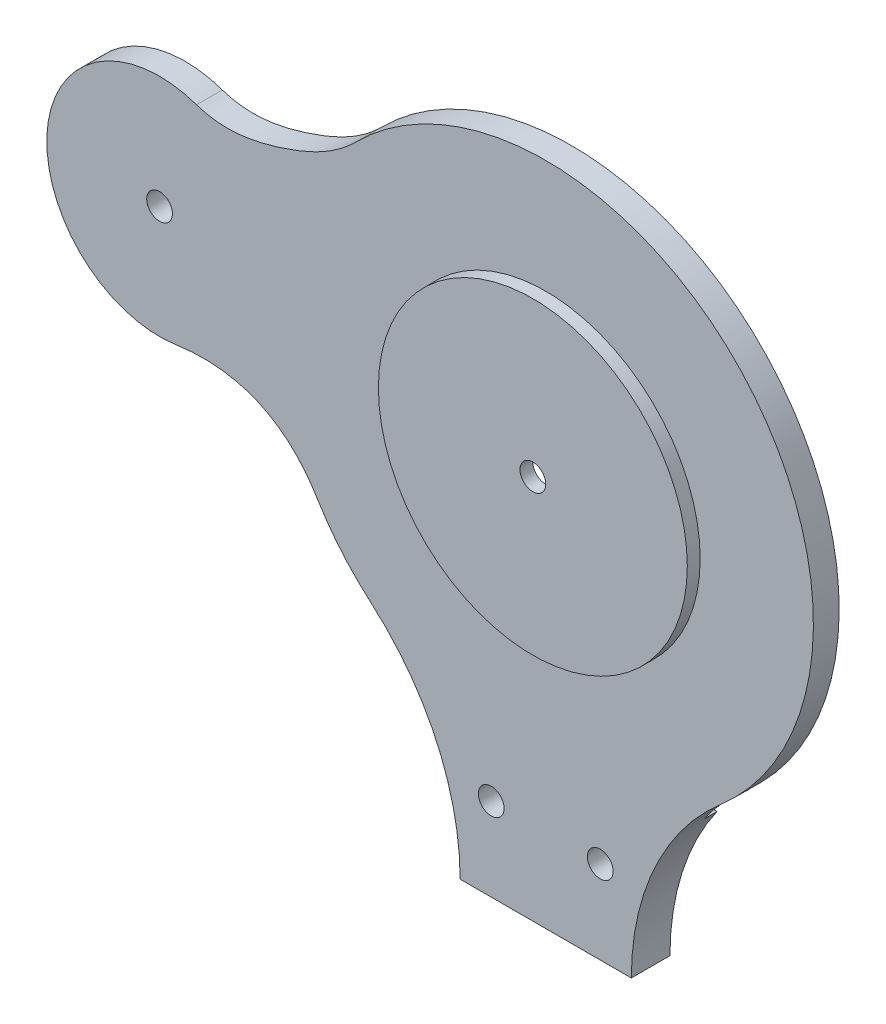
ISO-10303-21;
HEADER;
FILE_DESCRIPTION(('STEP AP214'),'2;1');
FILE_NAME('part.step','',(''),(''),'','','');
FILE_SCHEMA(('AUTOMOTIVE_DESIGN { 1 0 10303 214 1 1 1 1 }'));
ENDSEC;
DATA;
#1=APPLICATION_CONTEXT('core data for automotive mechanical design processes');
#2=APPLICATION_PROTOCOL_DEFINITION('international standard','automotive_design',2000,#1);
#3=PRODUCT_CONTEXT('',#1,'mechanical');
#4=PRODUCT('Part','Part','',(#3));
#5=PRODUCT_RELATED_PRODUCT_CATEGORY('part','',(#4));
#6=PRODUCT_DEFINITION_FORMATION('','',#4);
#7=PRODUCT_DEFINITION_CONTEXT('part definition',#1,'design');
#8=PRODUCT_DEFINITION('design','',#6,#7);
#9=PRODUCT_DEFINITION_SHAPE('','',#8);
#10=(LENGTH_UNIT() NAMED_UNIT(*) SI_UNIT(.MILLI.,.METRE.));
#11=(NAMED_UNIT(*) PLANE_ANGLE_UNIT() SI_UNIT($,.RADIAN.));
#12=(NAMED_UNIT(*) SI_UNIT($,.STERADIAN.) SOLID_ANGLE_UNIT());
#13=UNCERTAINTY_MEASURE_WITH_UNIT(LENGTH_MEASURE(1.E-05),#10,'distance_accuracy_value','');
#14=(GEOMETRIC_REPRESENTATION_CONTEXT(3) GLOBAL_UNCERTAINTY_ASSIGNED_CONTEXT((#13)) GLOBAL_UNIT_ASSIGNED_CONTEXT((#10,
#11,#12)) REPRESENTATION_CONTEXT('',''));
#15=CARTESIAN_POINT('',(0.,0.,0.));
#16=DIRECTION('',(0.,0.,1.));
#17=DIRECTION('',(1.,0.,0.));
#18=AXIS2_PLACEMENT_3D('',#15,#16,#17);
#19=CARTESIAN_POINT('',(0.,-52.8237291338587,5.08));
#20=DIRECTION('',(0.,0.,-1.));
#21=DIRECTION('',(-1.,0.,0.));
#22=AXIS2_PLACEMENT_3D('',#19,#20,#21);
#23=CYLINDRICAL_SURFACE('',#22,52.8237291338587);
#24=DIRECTION('',(0.,0.,1.));
#25=VECTOR('',#24,1.);
#26=CARTESIAN_POINT('',(-45.1618112271935,-80.2236774237117,-88.7850163484781));
#27=LINE('',#26,#25);
#28=CARTESIAN_POINT('',(-45.1618112271935,-80.2236774237117,0.));
#29=VERTEX_POINT('',#28);
#30=CARTESIAN_POINT('',(-45.1618112271935,-80.2236774237117,5.08));
#31=VERTEX_POINT('',#30);
#32=EDGE_CURVE('E151',#29,#31,#27,.T.);
#33=ORIENTED_EDGE('',*,*,#32,.F.);
#34=CARTESIAN_POINT('',(0.,-52.8237291338587,0.));
#35=DIRECTION('',(0.,0.,1.));
#36=DIRECTION('',(1.,0.,0.));
#37=AXIS2_PLACEMENT_3D('',#34,#35,#36);
#38=CIRCLE('',#37,52.8237291338587);
#39=CARTESIAN_POINT('',(-34.5064888002732,-92.8193362711919,0.));
#40=VERTEX_POINT('',#39);
#41=EDGE_CURVE('E226',#29,#40,#38,.T.);
#42=ORIENTED_EDGE('',*,*,#41,.T.);
#43=DIRECTION('',(0.,0.,-1.));
#44=VECTOR('',#43,1.);
#45=CARTESIAN_POINT('',(-34.5064888002732,-92.8193362711919,5.08));
#46=LINE('',#45,#44);
#47=CARTESIAN_POINT('',(-34.5064888002732,-92.8193362711919,5.08));
#48=VERTEX_POINT('',#47);
#49=EDGE_CURVE('E234',#48,#40,#46,.T.);
#50=ORIENTED_EDGE('',*,*,#49,.F.);
#51=CARTESIAN_POINT('',(0.,-52.8237291338587,5.08));
#52=DIRECTION('',(0.,0.,1.));
#53=DIRECTION('',(1.,0.,0.));
#54=AXIS2_PLACEMENT_3D('',#51,#52,#53);
#55=CIRCLE('',#54,52.8237291338587);
#56=EDGE_CURVE('E49',#31,#48,#55,.T.);
#57=ORIENTED_EDGE('',*,*,#56,.F.);
#58=EDGE_LOOP('',(#33,#42,#50,#57));
#59=FACE_BOUND('',#58,.T.);
#60=ADVANCED_FACE('F34',(#59),#23,.T.);
#61=CARTESIAN_POINT('',(67.691,-131.282672273614,0.));
#62=DIRECTION('',(0.,0.,1.));
#63=DIRECTION('',(1.,0.,0.));
#64=AXIS2_PLACEMENT_3D('',#61,#62,#63);
#65=PLANE('',#64);
#66=CARTESIAN_POINT('',(0.,-52.8237291338587,0.));
#67=DIRECTION('',(0.,0.,1.));
#68=DIRECTION('',(1.,0.,0.));
#69=AXIS2_PLACEMENT_3D('',#66,#67,#68);
#70=CIRCLE('',#69,24.4550559288067);
#71=CARTESIAN_POINT('',(24.4550559288067,-52.8237291338587,0.));
#72=VERTEX_POINT('',#71);
#73=EDGE_CURVE('E212',#72,#72,#70,.T.);
#74=ORIENTED_EDGE('',*,*,#73,.T.);
#75=EDGE_LOOP('',(#74));
#76=FACE_BOUND('',#75,.T.);
#77=CARTESIAN_POINT('',(0.,-52.8237291338587,0.));
#78=DIRECTION('',(0.,0.,-1.));
#79=DIRECTION('',(-1.,0.,0.));
#80=AXIS2_PLACEMENT_3D('',#77,#78,#79);
#81=CIRCLE('',#80,37.9583957745626);
#82=CARTESIAN_POINT('',(-37.9583957745626,-52.8237291338587,0.));
#83=VERTEX_POINT('',#82);
#84=EDGE_CURVE('E162',#83,#83,#81,.T.);
#85=ORIENTED_EDGE('',*,*,#84,.T.);
#86=EDGE_LOOP('',(#85));
#87=FACE_BOUND('',#86,.T.);
#88=ADVANCED_FACE('F326',(#76,#87),#65,.F.);
#89=CARTESIAN_POINT('',(-76.2,-45.9724694607301,0.));
#90=DIRECTION('',(0.,0.,1.));
#91=DIRECTION('',(1.,0.,0.));
#92=AXIS2_PLACEMENT_3D('',#89,#90,#91);
#93=CIRCLE('',#92,2.54);
#94=CARTESIAN_POINT('',(-73.66,-45.9724694607301,0.));
#95=VERTEX_POINT('',#94);
#96=EDGE_CURVE('E133',#95,#95,#93,.T.);
#97=ORIENTED_EDGE('',*,*,#96,.T.);
#98=EDGE_LOOP('',(#97));
#99=FACE_BOUND('',#98,.T.);
#100=CARTESIAN_POINT('',(0.,-52.8237291338587,0.));
#101=DIRECTION('',(0.,0.,1.));
#102=DIRECTION('',(1.,0.,0.));
#103=AXIS2_PLACEMENT_3D('',#100,#101,#102);
#104=CIRCLE('',#103,45.3360394371051);
#105=CARTESIAN_POINT('',(45.3360394371051,-52.8237291338587,0.));
#106=VERTEX_POINT('',#105);
#107=EDGE_CURVE('E11',#106,#106,#104,.F.);
#108=ORIENTED_EDGE('',*,*,#107,.F.);
#109=EDGE_LOOP('',(#108));
#110=FACE_BOUND('',#109,.T.);
#111=DIRECTION('',(1.,0.,0.));
#112=VECTOR('',#111,1.);
#113=CARTESIAN_POINT('',(26.195306339759,-101.978279980727,0.));
#114=LINE('',#113,#112);
#115=CARTESIAN_POINT('',(-26.195306339759,-101.978279980727,0.));
#116=VERTEX_POINT('',#115);
#117=CARTESIAN_POINT('',(26.195306339759,-101.978279980727,0.));
#118=VERTEX_POINT('',#117);
#119=EDGE_CURVE('E171',#116,#118,#114,.T.);
#120=ORIENTED_EDGE('',*,*,#119,.F.);
#121=CARTESIAN_POINT('',(-67.691,-131.282672273614,0.));
#122=DIRECTION('',(0.,0.,-1.));
#123=DIRECTION('',(1.,0.,0.));
#124=AXIS2_PLACEMENT_3D('',#121,#122,#123);
#125=CIRCLE('',#124,50.8);
#126=EDGE_CURVE('E218',#40,#116,#125,.T.);
#127=ORIENTED_EDGE('',*,*,#126,.F.);
#128=ORIENTED_EDGE('',*,*,#41,.F.);
#129=CARTESIAN_POINT('',(-72.9914132998963,-67.9938641825907,0.));
#130=CARTESIAN_POINT('',(-65.5082150756756,-66.9035385878799,0.));
#131=CARTESIAN_POINT('',(-55.0333885756071,-68.6406887311446,0.));
#132=CARTESIAN_POINT('',(-47.5743131665912,-76.2472846210777,0.));
#133=CARTESIAN_POINT('',(-45.1618112271935,-80.2236774237117,0.));
#134=B_SPLINE_CURVE_WITH_KNOTS('',3,(#129,#130,#131,#132,#133),.UNSPECIFIED.,.F.,.F.,(4,1,4),
(0.,0.604504859085891,1.),.UNSPECIFIED.);
#135=CARTESIAN_POINT('',(-72.9914132998963,-67.9938641825907,0.));
#136=VERTEX_POINT('',#135);
#137=EDGE_CURVE('E150',#29,#136,#134,.F.);
#138=ORIENTED_EDGE('',*,*,#137,.T.);
#139=CARTESIAN_POINT('',(-76.2,-45.9724694607301,0.));
#140=DIRECTION('',(0.,0.,1.));
#141=DIRECTION('',(1.,0.,0.));
#142=AXIS2_PLACEMENT_3D('',#139,#140,#141);
#143=CIRCLE('',#142,22.2539177249327);
#144=CARTESIAN_POINT('',(-68.9001800028994,-24.9498748987355,0.));
#145=VERTEX_POINT('',#144);
#146=EDGE_CURVE('E154',#136,#145,#143,.F.);
#147=ORIENTED_EDGE('',*,*,#146,.T.);
#148=CARTESIAN_POINT('',(-68.9001800028994,-24.9498748987355,0.));
#149=CARTESIAN_POINT('',(-63.2971972314928,-26.8954371154976,0.));
#150=CARTESIAN_POINT('',(-51.3897080482479,-24.415182371124,0.));
#151=CARTESIAN_POINT('',(-41.5692824440602,-19.7274128038788,0.));
#152=CARTESIAN_POINT('',(-37.5245833339332,-15.6450792764207,0.));
#153=B_SPLINE_CURVE_WITH_KNOTS('',3,(#148,#149,#150,#151,#152),.UNSPECIFIED.,.F.,.F.,(4,1,4),
(0.,0.520070066682019,1.),.UNSPECIFIED.);
#154=CARTESIAN_POINT('',(-37.5245833339332,-15.6450792764207,0.));
#155=VERTEX_POINT('',#154);
#156=EDGE_CURVE('E118',#155,#145,#153,.F.);
#157=ORIENTED_EDGE('',*,*,#156,.F.);
#158=CARTESIAN_POINT('',(34.5064888002731,-92.819336271192,0.));
#159=VERTEX_POINT('',#158);
#160=EDGE_CURVE('E227',#159,#155,#38,.T.);
#161=ORIENTED_EDGE('',*,*,#160,.F.);
#162=CARTESIAN_POINT('',(67.691,-131.282672273614,0.));
#163=DIRECTION('',(0.,0.,-1.));
#164=DIRECTION('',(1.,0.,0.));
#165=AXIS2_PLACEMENT_3D('',#162,#163,#164);
#166=CIRCLE('',#165,50.8);
#167=EDGE_CURVE('E215',#118,#159,#166,.T.);
#168=ORIENTED_EDGE('',*,*,#167,.F.);
#169=EDGE_LOOP('',(#120,#127,#128,#138,#147,#157,#161,#168));
#170=FACE_BOUND('',#169,.T.);
#171=ADVANCED_FACE('F245',(#99,#110,#170),#65,.F.);
#172=CARTESIAN_POINT('',(67.691,-131.282672273614,5.08));
#173=DIRECTION('',(0.,0.,1.));
#174=DIRECTION('',(1.,0.,0.));
#175=AXIS2_PLACEMENT_3D('',#172,#173,#174);
#176=PLANE('',#175);
#177=CARTESIAN_POINT('',(-76.2,-45.9724694607301,5.08));
#178=DIRECTION('',(0.,0.,1.));
#179=DIRECTION('',(1.,0.,0.));
#180=AXIS2_PLACEMENT_3D('',#177,#178,#179);
#181=CIRCLE('',#180,2.54);
#182=CARTESIAN_POINT('',(-73.66,-45.9724694607301,5.08));
#183=VERTEX_POINT('',#182);
#184=EDGE_CURVE('E367',#183,#183,#181,.T.);
#185=ORIENTED_EDGE('',*,*,#184,.F.);
#186=EDGE_LOOP('',(#185));
#187=FACE_BOUND('',#186,.T.);
#188=CARTESIAN_POINT('',(0.,-52.8237291338587,5.08));
#189=DIRECTION('',(0.,0.,1.));
#190=DIRECTION('',(1.,0.,0.));
#191=AXIS2_PLACEMENT_3D('',#188,#189,#190);
#192=CIRCLE('',#191,30.48);
#193=CARTESIAN_POINT('',(30.48,-52.8237291338587,5.08));
#194=VERTEX_POINT('',#193);
#195=EDGE_CURVE('E197',#194,#194,#192,.T.);
#196=ORIENTED_EDGE('',*,*,#195,.F.);
#197=EDGE_LOOP('',(#196));
#198=FACE_BOUND('',#197,.T.);
#199=CARTESIAN_POINT('',(-10.7564051785917,-114.872047192808,5.08));
#200=DIRECTION('',(0.,0.,1.));
#201=DIRECTION('',(1.,0.,0.));
#202=AXIS2_PLACEMENT_3D('',#199,#200,#201);
#203=CIRCLE('',#202,2.54);
#204=CARTESIAN_POINT('',(-8.2164051785917,-114.872047192808,5.08));
#205=VERTEX_POINT('',#204);
#206=EDGE_CURVE('E209',#205,#205,#203,.T.);
#207=ORIENTED_EDGE('',*,*,#206,.F.);
#208=EDGE_LOOP('',(#207));
#209=FACE_BOUND('',#208,.T.);
#210=CARTESIAN_POINT('',(67.691,-131.282672273614,5.08));
#211=DIRECTION('',(0.,0.,-1.));
#212=DIRECTION('',(1.,0.,0.));
#213=AXIS2_PLACEMENT_3D('',#210,#211,#212);
#214=CIRCLE('',#213,50.8);
#215=CARTESIAN_POINT('',(16.891,-131.282672273614,5.08));
#216=VERTEX_POINT('',#215);
#217=CARTESIAN_POINT('',(34.5064888002731,-92.819336271192,5.08));
#218=VERTEX_POINT('',#217);
#219=EDGE_CURVE('E216',#216,#218,#214,.T.);
#220=ORIENTED_EDGE('',*,*,#219,.T.);
#221=CARTESIAN_POINT('',(-37.5245833339332,-15.6450792764207,5.08));
#222=VERTEX_POINT('',#221);
#223=EDGE_CURVE('E132',#218,#222,#55,.T.);
#224=ORIENTED_EDGE('',*,*,#223,.T.);
#225=CARTESIAN_POINT('',(-68.9001800028994,-24.9498748987355,5.08));
#226=CARTESIAN_POINT('',(-63.2971972314928,-26.8954371154976,5.08));
#227=CARTESIAN_POINT('',(-51.3897080482479,-24.415182371124,5.08));
#228=CARTESIAN_POINT('',(-41.5692824440602,-19.7274128038788,5.08));
#229=CARTESIAN_POINT('',(-37.5245833339332,-15.6450792764207,5.08));
#230=B_SPLINE_CURVE_WITH_KNOTS('',3,(#225,#226,#227,#228,#229),.UNSPECIFIED.,.F.,.F.,(4,1,4),
(0.,0.520070066682019,1.),.UNSPECIFIED.);
#231=CARTESIAN_POINT('',(-68.9001800028994,-24.9498748987355,5.08));
#232=VERTEX_POINT('',#231);
#233=EDGE_CURVE('E116',#232,#222,#230,.T.);
#234=ORIENTED_EDGE('',*,*,#233,.F.);
#235=CARTESIAN_POINT('',(-76.2,-45.9724694607301,5.08));
#236=DIRECTION('',(0.,0.,1.));
#237=DIRECTION('',(1.,0.,0.));
#238=AXIS2_PLACEMENT_3D('',#235,#236,#237);
#239=CIRCLE('',#238,22.2539177249327);
#240=CARTESIAN_POINT('',(-72.9914132998963,-67.9938641825907,5.08));
#241=VERTEX_POINT('',#240);
#242=EDGE_CURVE('E131',#232,#241,#239,.T.);
#243=ORIENTED_EDGE('',*,*,#242,.T.);
#244=CARTESIAN_POINT('',(-72.9914132998963,-67.9938641825907,5.08));
#245=CARTESIAN_POINT('',(-65.5082150756756,-66.9035385878799,5.08));
#246=CARTESIAN_POINT('',(-55.0333885756071,-68.6406887311446,5.08));
#247=CARTESIAN_POINT('',(-47.5743131665912,-76.2472846210777,5.08));
#248=CARTESIAN_POINT('',(-45.1618112271935,-80.2236774237117,5.08));
#249=B_SPLINE_CURVE_WITH_KNOTS('',3,(#244,#245,#246,#247,#248),.UNSPECIFIED.,.F.,.F.,(4,1,4),
(0.,0.604504859085891,1.),.UNSPECIFIED.);
#250=EDGE_CURVE('E123',#241,#31,#249,.T.);
#251=ORIENTED_EDGE('',*,*,#250,.T.);
#252=ORIENTED_EDGE('',*,*,#56,.T.);
#253=CARTESIAN_POINT('',(-67.691,-131.282672273614,5.08));
#254=DIRECTION('',(0.,0.,-1.));
#255=DIRECTION('',(1.,0.,0.));
#256=AXIS2_PLACEMENT_3D('',#253,#254,#255);
#257=CIRCLE('',#256,50.8);
#258=CARTESIAN_POINT('',(-16.891,-131.282672273614,5.08));
#259=VERTEX_POINT('',#258);
#260=EDGE_CURVE('E220',#48,#259,#257,.T.);
#261=ORIENTED_EDGE('',*,*,#260,.T.);
#262=DIRECTION('',(1.,0.,0.));
#263=VECTOR('',#262,1.);
#264=CARTESIAN_POINT('',(-16.891,-131.282672273614,5.08));
#265=LINE('',#264,#263);
#266=EDGE_CURVE('E222',#259,#216,#265,.T.);
#267=ORIENTED_EDGE('',*,*,#266,.T.);
#268=EDGE_LOOP('',(#220,#224,#234,#243,#251,#252,#261,#267));
#269=FACE_BOUND('',#268,.T.);
#270=CARTESIAN_POINT('',(10.7564051785917,-114.872047192808,5.08));
#271=DIRECTION('',(0.,0.,1.));
#272=DIRECTION('',(1.,0.,0.));
#273=AXIS2_PLACEMENT_3D('',#270,#271,#272);
#274=CIRCLE('',#273,2.54);
#275=CARTESIAN_POINT('',(13.2964051785917,-114.872047192808,5.08));
#276=VERTEX_POINT('',#275);
#277=EDGE_CURVE('E206',#276,#276,#274,.T.);
#278=ORIENTED_EDGE('',*,*,#277,.F.);
#279=EDGE_LOOP('',(#278));
#280=FACE_BOUND('',#279,.T.);
#281=ADVANCED_FACE('F128',(#187,#198,#209,#269,#280),#176,.T.);
#282=CARTESIAN_POINT('',(67.691,-131.282672273614,5.08));
#283=DIRECTION('',(0.,0.,-1.));
#284=DIRECTION('',(-1.,0.,0.));
#285=AXIS2_PLACEMENT_3D('',#282,#283,#284);
#286=CYLINDRICAL_SURFACE('',#285,50.8);
#287=DIRECTION('',(0.,0.,-1.));
#288=VECTOR('',#287,1.);
#289=CARTESIAN_POINT('',(16.891,-131.282672273614,5.08));
#290=LINE('',#289,#288);
#291=CARTESIAN_POINT('',(16.891,-131.282672273614,-2.54));
#292=VERTEX_POINT('',#291);
#293=EDGE_CURVE('E224',#216,#292,#290,.T.);
#294=ORIENTED_EDGE('',*,*,#293,.T.);
#295=CARTESIAN_POINT('',(67.691,-131.282672273614,-2.54));
#296=DIRECTION('',(0.,0.,1.));
#297=DIRECTION('',(-1.,0.,0.));
#298=AXIS2_PLACEMENT_3D('',#295,#296,#297);
#299=CIRCLE('',#298,50.8);
#300=CARTESIAN_POINT('',(26.195306339759,-101.978279980727,-2.54));
#301=VERTEX_POINT('',#300);
#302=EDGE_CURVE('E177',#301,#292,#299,.T.);
#303=ORIENTED_EDGE('',*,*,#302,.F.);
#304=DIRECTION('',(0.,0.,1.));
#305=VECTOR('',#304,1.);
#306=CARTESIAN_POINT('',(26.195306339759,-101.978279980727,-2.54));
#307=LINE('',#306,#305);
#308=EDGE_CURVE('E183',#301,#118,#307,.T.);
#309=ORIENTED_EDGE('',*,*,#308,.T.);
#310=ORIENTED_EDGE('',*,*,#167,.T.);
#311=DIRECTION('',(0.,0.,-1.));
#312=VECTOR('',#311,1.);
#313=CARTESIAN_POINT('',(34.5064888002731,-92.819336271192,5.08));
#314=LINE('',#313,#312);
#315=EDGE_CURVE('E42',#218,#159,#314,.T.);
#316=ORIENTED_EDGE('',*,*,#315,.F.);
#317=ORIENTED_EDGE('',*,*,#219,.F.);
#318=EDGE_LOOP('',(#294,#303,#309,#310,#316,#317));
#319=FACE_BOUND('',#318,.T.);
#320=ADVANCED_FACE('F36',(#319),#286,.F.);
#321=ORIENTED_EDGE('',*,*,#160,.T.);
#322=DIRECTION('',(0.,0.,1.));
#323=VECTOR('',#322,1.);
#324=CARTESIAN_POINT('',(-37.5245833339332,-15.6450792764207,-88.7850163484781));
#325=LINE('',#324,#323);
#326=EDGE_CURVE('E57',#155,#222,#325,.T.);
#327=ORIENTED_EDGE('',*,*,#326,.T.);
#328=ORIENTED_EDGE('',*,*,#223,.F.);
#329=ORIENTED_EDGE('',*,*,#315,.T.);
#330=EDGE_LOOP('',(#321,#327,#328,#329));
#331=FACE_BOUND('',#330,.T.);
#332=ADVANCED_FACE('F238',(#331),#23,.T.);
#333=CARTESIAN_POINT('',(-67.691,-131.282672273614,5.08));
#334=DIRECTION('',(0.,0.,-1.));
#335=DIRECTION('',(-1.,0.,0.));
#336=AXIS2_PLACEMENT_3D('',#333,#334,#335);
#337=CYLINDRICAL_SURFACE('',#336,50.8);
#338=ORIENTED_EDGE('',*,*,#126,.T.);
#339=DIRECTION('',(0.,0.,1.));
#340=VECTOR('',#339,1.);
#341=CARTESIAN_POINT('',(-26.195306339759,-101.978279980727,-2.54));
#342=LINE('',#341,#340);
#343=CARTESIAN_POINT('',(-26.195306339759,-101.978279980727,-2.54));
#344=VERTEX_POINT('',#343);
#345=EDGE_CURVE('E188',#344,#116,#342,.T.);
#346=ORIENTED_EDGE('',*,*,#345,.F.);
#347=CARTESIAN_POINT('',(-67.691,-131.282672273614,-2.54));
#348=DIRECTION('',(0.,0.,1.));
#349=DIRECTION('',(-1.,0.,0.));
#350=AXIS2_PLACEMENT_3D('',#347,#348,#349);
#351=CIRCLE('',#350,50.8);
#352=CARTESIAN_POINT('',(-16.891,-131.282672273614,-2.54));
#353=VERTEX_POINT('',#352);
#354=EDGE_CURVE('E172',#353,#344,#351,.T.);
#355=ORIENTED_EDGE('',*,*,#354,.F.);
#356=DIRECTION('',(0.,0.,-1.));
#357=VECTOR('',#356,1.);
#358=CARTESIAN_POINT('',(-16.891,-131.282672273614,5.08));
#359=LINE('',#358,#357);
#360=EDGE_CURVE('E232',#259,#353,#359,.T.);
#361=ORIENTED_EDGE('',*,*,#360,.F.);
#362=ORIENTED_EDGE('',*,*,#260,.F.);
#363=ORIENTED_EDGE('',*,*,#49,.T.);
#364=EDGE_LOOP('',(#338,#346,#355,#361,#362,#363));
#365=FACE_BOUND('',#364,.T.);
#366=ADVANCED_FACE('F330',(#365),#337,.F.);
#367=CARTESIAN_POINT('',(-16.891,-131.282672273614,5.08));
#368=DIRECTION('',(0.,1.,0.));
#369=DIRECTION('',(-1.,0.,0.));
#370=AXIS2_PLACEMENT_3D('',#367,#368,#369);
#371=PLANE('',#370);
#372=ORIENTED_EDGE('',*,*,#360,.T.);
#373=DIRECTION('',(-1.,0.,0.));
#374=VECTOR('',#373,1.);
#375=CARTESIAN_POINT('',(-16.891,-131.282672273614,-2.54));
#376=LINE('',#375,#374);
#377=EDGE_CURVE('E180',#292,#353,#376,.T.);
#378=ORIENTED_EDGE('',*,*,#377,.F.);
#379=ORIENTED_EDGE('',*,*,#293,.F.);
#380=ORIENTED_EDGE('',*,*,#266,.F.);
#381=EDGE_LOOP('',(#372,#378,#379,#380));
#382=FACE_BOUND('',#381,.T.);
#383=ADVANCED_FACE('F319',(#382),#371,.F.);
#384=CARTESIAN_POINT('',(0.,-52.8237291338587,5.08));
#385=DIRECTION('',(0.,0.,-1.));
#386=DIRECTION('',(-1.,0.,0.));
#387=AXIS2_PLACEMENT_3D('',#384,#385,#386);
#388=CYLINDRICAL_SURFACE('',#387,24.4550559288067);
#389=CARTESIAN_POINT('',(0.,-52.8237291338587,5.08));
#390=DIRECTION('',(0.,0.,1.));
#391=DIRECTION('',(1.,0.,0.));
#392=AXIS2_PLACEMENT_3D('',#389,#390,#391);
#393=CIRCLE('',#392,24.4550559288067);
#394=CARTESIAN_POINT('',(24.4550559288067,-52.8237291338587,5.08));
#395=VERTEX_POINT('',#394);
#396=EDGE_CURVE('E201',#395,#395,#393,.T.);
#397=ORIENTED_EDGE('',*,*,#396,.T.);
#398=EDGE_LOOP('',(#397));
#399=FACE_BOUND('',#398,.T.);
#400=ORIENTED_EDGE('',*,*,#73,.F.);
#401=EDGE_LOOP('',(#400));
#402=FACE_BOUND('',#401,.T.);
#403=ADVANCED_FACE('F315',(#399,#402),#388,.F.);
#404=CARTESIAN_POINT('',(-10.7564051785917,-114.872047192808,5.08));
#405=DIRECTION('',(0.,0.,-1.));
#406=DIRECTION('',(-1.,0.,0.));
#407=AXIS2_PLACEMENT_3D('',#404,#405,#406);
#408=CYLINDRICAL_SURFACE('',#407,2.54);
#409=ORIENTED_EDGE('',*,*,#206,.T.);
#410=EDGE_LOOP('',(#409));
#411=FACE_BOUND('',#410,.T.);
#412=CARTESIAN_POINT('',(-10.7564051785917,-114.872047192808,-2.54));
#413=DIRECTION('',(0.,0.,1.));
#414=DIRECTION('',(1.,0.,0.));
#415=AXIS2_PLACEMENT_3D('',#412,#413,#414);
#416=CIRCLE('',#415,2.54);
#417=CARTESIAN_POINT('',(-8.2164051785917,-114.872047192808,-2.54));
#418=VERTEX_POINT('',#417);
#419=EDGE_CURVE('E159',#418,#418,#416,.T.);
#420=ORIENTED_EDGE('',*,*,#419,.F.);
#421=EDGE_LOOP('',(#420));
#422=FACE_BOUND('',#421,.T.);
#423=ADVANCED_FACE('F311',(#411,#422),#408,.F.);
#424=CARTESIAN_POINT('',(10.7564051785917,-114.872047192808,5.08));
#425=DIRECTION('',(0.,0.,-1.));
#426=DIRECTION('',(-1.,0.,0.));
#427=AXIS2_PLACEMENT_3D('',#424,#425,#426);
#428=CYLINDRICAL_SURFACE('',#427,2.54);
#429=ORIENTED_EDGE('',*,*,#277,.T.);
#430=EDGE_LOOP('',(#429));
#431=FACE_BOUND('',#430,.T.);
#432=CARTESIAN_POINT('',(10.7564051785917,-114.872047192808,-2.54));
#433=DIRECTION('',(0.,0.,1.));
#434=DIRECTION('',(1.,0.,0.));
#435=AXIS2_PLACEMENT_3D('',#432,#433,#434);
#436=CIRCLE('',#435,2.54);
#437=CARTESIAN_POINT('',(13.2964051785917,-114.872047192808,-2.54));
#438=VERTEX_POINT('',#437);
#439=EDGE_CURVE('E156',#438,#438,#436,.T.);
#440=ORIENTED_EDGE('',*,*,#439,.F.);
#441=EDGE_LOOP('',(#440));
#442=FACE_BOUND('',#441,.T.);
#443=ADVANCED_FACE('F304',(#431,#442),#428,.F.);
#444=CARTESIAN_POINT('',(0.,-52.8237291338587,5.08));
#445=DIRECTION('',(0.,0.,1.));
#446=DIRECTION('',(1.,0.,0.));
#447=AXIS2_PLACEMENT_3D('',#444,#445,#446);
#448=PLANE('',#447);
#449=CARTESIAN_POINT('',(0.,-52.8237291338587,5.08));
#450=DIRECTION('',(0.,0.,1.));
#451=DIRECTION('',(1.,0.,0.));
#452=AXIS2_PLACEMENT_3D('',#449,#450,#451);
#453=CIRCLE('',#452,2.54);
#454=CARTESIAN_POINT('',(2.54000000000001,-52.8237291338587,5.08));
#455=VERTEX_POINT('',#454);
#456=EDGE_CURVE('E194',#455,#455,#453,.T.);
#457=ORIENTED_EDGE('',*,*,#456,.T.);
#458=EDGE_LOOP('',(#457));
#459=FACE_BOUND('',#458,.T.);
#460=ORIENTED_EDGE('',*,*,#396,.F.);
#461=EDGE_LOOP('',(#460));
#462=FACE_BOUND('',#461,.T.);
#463=ADVANCED_FACE('F301',(#459,#462),#448,.F.);
#464=CARTESIAN_POINT('',(0.,-52.8237291338587,7.62));
#465=DIRECTION('',(0.,0.,-1.));
#466=DIRECTION('',(-1.,0.,0.));
#467=AXIS2_PLACEMENT_3D('',#464,#465,#466);
#468=CYLINDRICAL_SURFACE('',#467,30.48);
#469=CARTESIAN_POINT('',(0.,-52.8237291338587,7.62));
#470=DIRECTION('',(0.,0.,1.));
#471=DIRECTION('',(1.,0.,0.));
#472=AXIS2_PLACEMENT_3D('',#469,#470,#471);
#473=CIRCLE('',#472,30.48);
#474=CARTESIAN_POINT('',(30.48,-52.8237291338587,7.62));
#475=VERTEX_POINT('',#474);
#476=EDGE_CURVE('E198',#475,#475,#473,.T.);
#477=ORIENTED_EDGE('',*,*,#476,.F.);
#478=EDGE_LOOP('',(#477));
#479=FACE_BOUND('',#478,.T.);
#480=ORIENTED_EDGE('',*,*,#195,.T.);
#481=EDGE_LOOP('',(#480));
#482=FACE_BOUND('',#481,.T.);
#483=ADVANCED_FACE('F299',(#479,#482),#468,.T.);
#484=CARTESIAN_POINT('',(0.,-52.8237291338587,7.62));
#485=DIRECTION('',(0.,0.,1.));
#486=DIRECTION('',(1.,0.,0.));
#487=AXIS2_PLACEMENT_3D('',#484,#485,#486);
#488=PLANE('',#487);
#489=CARTESIAN_POINT('',(0.,-52.8237291338587,7.62));
#490=DIRECTION('',(0.,0.,1.));
#491=DIRECTION('',(1.,0.,0.));
#492=AXIS2_PLACEMENT_3D('',#489,#490,#491);
#493=CIRCLE('',#492,2.54);
#494=CARTESIAN_POINT('',(2.54000000000001,-52.8237291338587,7.62));
#495=VERTEX_POINT('',#494);
#496=EDGE_CURVE('E191',#495,#495,#493,.T.);
#497=ORIENTED_EDGE('',*,*,#496,.F.);
#498=EDGE_LOOP('',(#497));
#499=FACE_BOUND('',#498,.T.);
#500=ORIENTED_EDGE('',*,*,#476,.T.);
#501=EDGE_LOOP('',(#500));
#502=FACE_BOUND('',#501,.T.);
#503=ADVANCED_FACE('F295',(#499,#502),#488,.T.);
#504=CARTESIAN_POINT('',(0.,-52.8237291338587,0.));
#505=DIRECTION('',(0.,0.,1.));
#506=DIRECTION('',(1.,0.,0.));
#507=AXIS2_PLACEMENT_3D('',#504,#505,#506);
#508=CYLINDRICAL_SURFACE('',#507,2.54);
#509=ORIENTED_EDGE('',*,*,#496,.T.);
#510=EDGE_LOOP('',(#509));
#511=FACE_BOUND('',#510,.T.);
#512=ORIENTED_EDGE('',*,*,#456,.F.);
#513=EDGE_LOOP('',(#512));
#514=FACE_BOUND('',#513,.T.);
#515=ADVANCED_FACE('F288',(#511,#514),#508,.F.);
#516=CARTESIAN_POINT('',(-67.691,-131.282672273614,-2.54));
#517=DIRECTION('',(0.,0.,-1.));
#518=DIRECTION('',(-1.,0.,0.));
#519=AXIS2_PLACEMENT_3D('',#516,#517,#518);
#520=PLANE('',#519);
#521=ORIENTED_EDGE('',*,*,#439,.T.);
#522=EDGE_LOOP('',(#521));
#523=FACE_BOUND('',#522,.T.);
#524=ORIENTED_EDGE('',*,*,#419,.T.);
#525=EDGE_LOOP('',(#524));
#526=FACE_BOUND('',#525,.T.);
#527=ORIENTED_EDGE('',*,*,#354,.T.);
#528=DIRECTION('',(1.,0.,0.));
#529=VECTOR('',#528,1.);
#530=CARTESIAN_POINT('',(26.195306339759,-101.978279980727,-2.54));
#531=LINE('',#530,#529);
#532=EDGE_CURVE('E175',#344,#301,#531,.T.);
#533=ORIENTED_EDGE('',*,*,#532,.T.);
#534=ORIENTED_EDGE('',*,*,#302,.T.);
#535=ORIENTED_EDGE('',*,*,#377,.T.);
#536=EDGE_LOOP('',(#527,#533,#534,#535));
#537=FACE_BOUND('',#536,.T.);
#538=ADVANCED_FACE('F285',(#523,#526,#537),#520,.T.);
#539=CARTESIAN_POINT('',(26.195306339759,-101.978279980727,-2.54));
#540=DIRECTION('',(0.,-1.,0.));
#541=DIRECTION('',(0.,0.,-1.));
#542=AXIS2_PLACEMENT_3D('',#539,#540,#541);
#543=PLANE('',#542);
#544=ORIENTED_EDGE('',*,*,#119,.T.);
#545=ORIENTED_EDGE('',*,*,#308,.F.);
#546=ORIENTED_EDGE('',*,*,#532,.F.);
#547=ORIENTED_EDGE('',*,*,#345,.T.);
#548=EDGE_LOOP('',(#544,#545,#546,#547));
#549=FACE_BOUND('',#548,.T.);
#550=ADVANCED_FACE('F280',(#549),#543,.F.);
#551=CARTESIAN_POINT('',(0.,-52.8237291338587,-2.54));
#552=DIRECTION('',(0.,0.,-1.));
#553=DIRECTION('',(-1.,0.,0.));
#554=AXIS2_PLACEMENT_3D('',#551,#552,#553);
#555=PLANE('',#554);
#556=CARTESIAN_POINT('',(0.,-52.8237291338587,-2.54));
#557=DIRECTION('',(0.,0.,-1.));
#558=DIRECTION('',(-1.,0.,0.));
#559=AXIS2_PLACEMENT_3D('',#556,#557,#558);
#560=CIRCLE('',#559,45.3360394371051);
#561=CARTESIAN_POINT('',(-45.3360394371051,-52.8237291338587,-2.54));
#562=VERTEX_POINT('',#561);
#563=EDGE_CURVE('E166',#562,#562,#560,.T.);
#564=ORIENTED_EDGE('',*,*,#563,.T.);
#565=EDGE_LOOP('',(#564));
#566=FACE_BOUND('',#565,.T.);
#567=CARTESIAN_POINT('',(0.,-52.8237291338587,-2.54));
#568=DIRECTION('',(0.,0.,-1.));
#569=DIRECTION('',(-1.,0.,0.));
#570=AXIS2_PLACEMENT_3D('',#567,#568,#569);
#571=CIRCLE('',#570,37.9583957745626);
#572=CARTESIAN_POINT('',(-37.9583957745626,-52.8237291338587,-2.54));
#573=VERTEX_POINT('',#572);
#574=EDGE_CURVE('E163',#573,#573,#571,.T.);
#575=ORIENTED_EDGE('',*,*,#574,.F.);
#576=EDGE_LOOP('',(#575));
#577=FACE_BOUND('',#576,.T.);
#578=ADVANCED_FACE('F277',(#566,#577),#555,.T.);
#579=CARTESIAN_POINT('',(0.,-52.8237291338587,-2.54));
#580=DIRECTION('',(0.,0.,1.));
#581=DIRECTION('',(1.,0.,0.));
#582=AXIS2_PLACEMENT_3D('',#579,#580,#581);
#583=CYLINDRICAL_SURFACE('',#582,45.3360394371051);
#584=ORIENTED_EDGE('',*,*,#563,.F.);
#585=EDGE_LOOP('',(#584));
#586=FACE_BOUND('',#585,.T.);
#587=ORIENTED_EDGE('',*,*,#107,.T.);
#588=EDGE_LOOP('',(#587));
#589=FACE_BOUND('',#588,.T.);
#590=ADVANCED_FACE('F275',(#586,#589),#583,.T.);
#591=CARTESIAN_POINT('',(0.,-52.8237291338587,-2.54));
#592=DIRECTION('',(0.,0.,1.));
#593=DIRECTION('',(1.,0.,0.));
#594=AXIS2_PLACEMENT_3D('',#591,#592,#593);
#595=CYLINDRICAL_SURFACE('',#594,37.9583957745626);
#596=ORIENTED_EDGE('',*,*,#574,.T.);
#597=EDGE_LOOP('',(#596));
#598=FACE_BOUND('',#597,.T.);
#599=ORIENTED_EDGE('',*,*,#84,.F.);
#600=EDGE_LOOP('',(#599));
#601=FACE_BOUND('',#600,.T.);
#602=ADVANCED_FACE('F271',(#598,#601),#595,.F.);
#603=CARTESIAN_POINT('',(-68.9001800028994,-24.9498748987355,-88.7850163484781));
#604=CARTESIAN_POINT('',(-63.2971972314928,-26.8954371154976,-88.7850163484781));
#605=CARTESIAN_POINT('',(-51.3897080482479,-24.415182371124,-88.7850163484781));
#606=CARTESIAN_POINT('',(-41.5692824440602,-19.7274128038788,-88.7850163484781));
#607=CARTESIAN_POINT('',(-37.5245833339332,-15.6450792764207,-88.7850163484781));
#608=B_SPLINE_CURVE_WITH_KNOTS('',3,(#603,#604,#605,#606,#607),.UNSPECIFIED.,.F.,.F.,(4,1,4),
(0.,0.520070066682019,1.),.UNSPECIFIED.);
#609=DIRECTION('',(0.,0.,1.));
#610=VECTOR('',#609,1.);
#611=SURFACE_OF_LINEAR_EXTRUSION('',#608,#610);
#612=ORIENTED_EDGE('',*,*,#326,.F.);
#613=ORIENTED_EDGE('',*,*,#156,.T.);
#614=DIRECTION('',(0.,0.,1.));
#615=VECTOR('',#614,1.);
#616=CARTESIAN_POINT('',(-68.9001800028994,-24.9498748987355,-88.7850163484781));
#617=LINE('',#616,#615);
#618=EDGE_CURVE('E113',#145,#232,#617,.T.);
#619=ORIENTED_EDGE('',*,*,#618,.T.);
#620=ORIENTED_EDGE('',*,*,#233,.T.);
#621=EDGE_LOOP('',(#612,#613,#619,#620));
#622=FACE_BOUND('',#621,.T.);
#623=ADVANCED_FACE('F115',(#622),#611,.F.);
#624=CARTESIAN_POINT('',(-72.9914132998963,-67.9938641825907,-88.7850163484781));
#625=CARTESIAN_POINT('',(-65.5082150756756,-66.9035385878799,-88.7850163484781));
#626=CARTESIAN_POINT('',(-55.0333885756071,-68.6406887311446,-88.7850163484781));
#627=CARTESIAN_POINT('',(-47.5743131665912,-76.2472846210777,-88.7850163484781));
#628=CARTESIAN_POINT('',(-45.1618112271935,-80.2236774237117,-88.7850163484781));
#629=B_SPLINE_CURVE_WITH_KNOTS('',3,(#624,#625,#626,#627,#628),.UNSPECIFIED.,.F.,.F.,(4,1,4),
(0.,0.604504859085891,1.),.UNSPECIFIED.);
#630=DIRECTION('',(0.,0.,1.));
#631=VECTOR('',#630,1.);
#632=SURFACE_OF_LINEAR_EXTRUSION('',#629,#631);
#633=ORIENTED_EDGE('',*,*,#137,.F.);
#634=ORIENTED_EDGE('',*,*,#32,.T.);
#635=ORIENTED_EDGE('',*,*,#250,.F.);
#636=DIRECTION('',(0.,0.,1.));
#637=VECTOR('',#636,1.);
#638=CARTESIAN_POINT('',(-72.9914132998963,-67.9938641825907,-88.7850163484781));
#639=LINE('',#638,#637);
#640=EDGE_CURVE('E122',#136,#241,#639,.T.);
#641=ORIENTED_EDGE('',*,*,#640,.F.);
#642=EDGE_LOOP('',(#633,#634,#635,#641));
#643=FACE_BOUND('',#642,.T.);
#644=ADVANCED_FACE('F270',(#643),#632,.T.);
#645=CARTESIAN_POINT('',(-76.2,-45.9724694607301,-88.7850163484781));
#646=DIRECTION('',(0.,0.,1.));
#647=DIRECTION('',(1.,0.,0.));
#648=AXIS2_PLACEMENT_3D('',#645,#646,#647);
#649=CYLINDRICAL_SURFACE('',#648,22.2539177249327);
#650=ORIENTED_EDGE('',*,*,#146,.F.);
#651=ORIENTED_EDGE('',*,*,#640,.T.);
#652=ORIENTED_EDGE('',*,*,#242,.F.);
#653=ORIENTED_EDGE('',*,*,#618,.F.);
#654=EDGE_LOOP('',(#650,#651,#652,#653));
#655=FACE_BOUND('',#654,.T.);
#656=ADVANCED_FACE('F135',(#655),#649,.T.);
#657=CARTESIAN_POINT('',(-76.2,-45.9724694607301,-2.54));
#658=DIRECTION('',(0.,0.,1.));
#659=DIRECTION('',(1.,0.,0.));
#660=AXIS2_PLACEMENT_3D('',#657,#658,#659);
#661=CYLINDRICAL_SURFACE('',#660,2.54);
#662=ORIENTED_EDGE('',*,*,#184,.T.);
#663=EDGE_LOOP('',(#662));
#664=FACE_BOUND('',#663,.T.);
#665=ORIENTED_EDGE('',*,*,#96,.F.);
#666=EDGE_LOOP('',(#665));
#667=FACE_BOUND('',#666,.T.);
#668=ADVANCED_FACE('F358',(#664,#667),#661,.F.);
#669=CLOSED_SHELL('',(#60,#88,#171,#281,#320,#332,#366,#383,#403,#423,#443,#463,#483,#503,#515,
#538,#550,#578,#590,#602,#623,#644,#656,#668));
#670=MANIFOLD_SOLID_BREP('B2',#669);
#671=ADVANCED_BREP_SHAPE_REPRESENTATION('',(#18,#670),#14);
#672=SHAPE_DEFINITION_REPRESENTATION(#9,#671);
ENDSEC;
END-ISO-10303-21;
